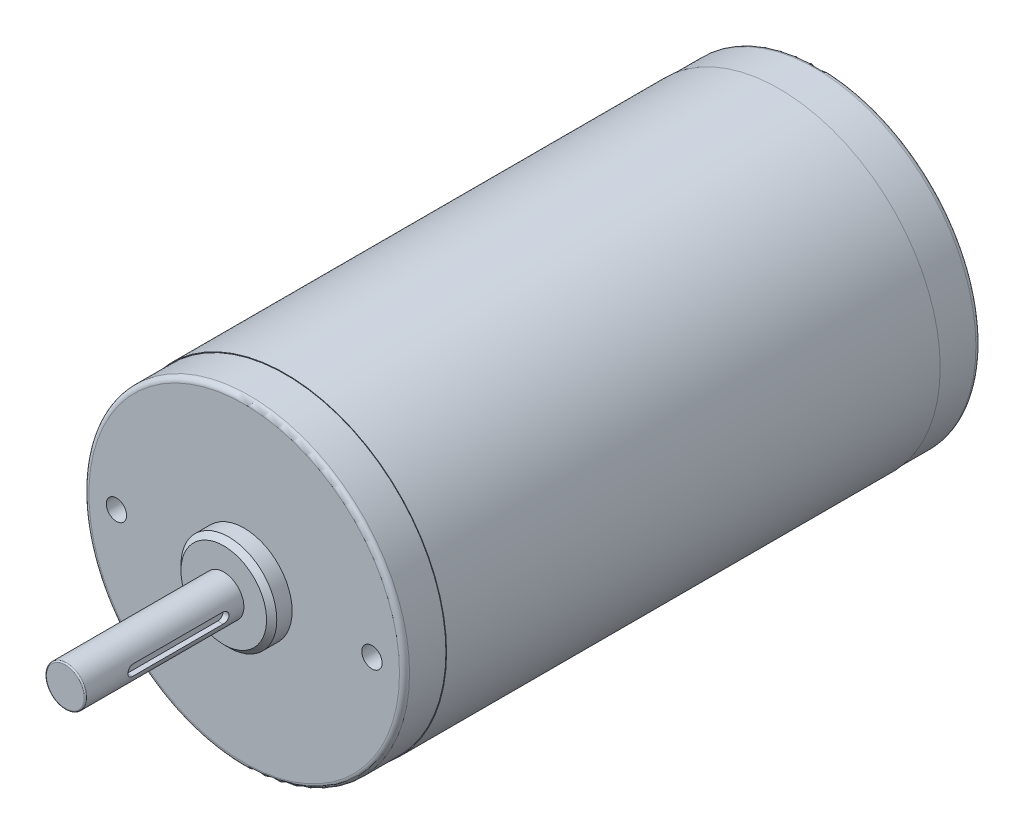
ISO-10303-21;
HEADER;
FILE_DESCRIPTION(('STEP AP214'),'2;1');
FILE_NAME('part.step','',(''),(''),'','','');
FILE_SCHEMA(('AUTOMOTIVE_DESIGN { 1 0 10303 214 1 1 1 1 }'));
ENDSEC;
DATA;
#1=APPLICATION_CONTEXT('core data for automotive mechanical design processes');
#2=APPLICATION_PROTOCOL_DEFINITION('international standard','automotive_design',2000,#1);
#3=PRODUCT_CONTEXT('',#1,'mechanical');
#4=PRODUCT('Part','Part','',(#3));
#5=PRODUCT_RELATED_PRODUCT_CATEGORY('part','',(#4));
#6=PRODUCT_DEFINITION_FORMATION('','',#4);
#7=PRODUCT_DEFINITION_CONTEXT('part definition',#1,'design');
#8=PRODUCT_DEFINITION('design','',#6,#7);
#9=PRODUCT_DEFINITION_SHAPE('','',#8);
#10=(LENGTH_UNIT() NAMED_UNIT(*) SI_UNIT(.MILLI.,.METRE.));
#11=(NAMED_UNIT(*) PLANE_ANGLE_UNIT() SI_UNIT($,.RADIAN.));
#12=(NAMED_UNIT(*) SI_UNIT($,.STERADIAN.) SOLID_ANGLE_UNIT());
#13=UNCERTAINTY_MEASURE_WITH_UNIT(LENGTH_MEASURE(1.E-05),#10,'distance_accuracy_value','');
#14=(GEOMETRIC_REPRESENTATION_CONTEXT(3) GLOBAL_UNCERTAINTY_ASSIGNED_CONTEXT((#13)) GLOBAL_UNIT_ASSIGNED_CONTEXT((#10,
#11,#12)) REPRESENTATION_CONTEXT('',''));
#15=CARTESIAN_POINT('',(0.,0.,0.));
#16=DIRECTION('',(0.,0.,1.));
#17=DIRECTION('',(1.,0.,0.));
#18=AXIS2_PLACEMENT_3D('',#15,#16,#17);
#19=CARTESIAN_POINT('',(35.56,109.2962,54.614));
#20=DIRECTION('',(0.,0.,1.));
#21=DIRECTION('',(1.,0.,0.));
#22=AXIS2_PLACEMENT_3D('',#19,#20,#21);
#23=PLANE('',#22);
#24=CARTESIAN_POINT('',(35.56,109.2962,54.614));
#25=DIRECTION('',(0.,0.,-1.));
#26=DIRECTION('',(1.,0.,0.));
#27=AXIS2_PLACEMENT_3D('',#24,#25,#26);
#28=CIRCLE('',#27,3.7460000000201);
#29=CARTESIAN_POINT('',(39.3060000000201,109.2962,54.614));
#30=VERTEX_POINT('',#29);
#31=EDGE_CURVE('E76',#30,#30,#28,.T.);
#32=ORIENTED_EDGE('',*,*,#31,.F.);
#33=EDGE_LOOP('',(#32));
#34=FACE_BOUND('',#33,.T.);
#35=ADVANCED_FACE('F17',(#34),#23,.T.);
#36=CARTESIAN_POINT('',(38.36,109.2962,16.4984772078548));
#37=DIRECTION('',(1.,0.,0.));
#38=DIRECTION('',(0.,0.,-1.));
#39=AXIS2_PLACEMENT_3D('',#36,#37,#38);
#40=PLANE('',#39);
#41=DIRECTION('',(0.,0.,1.));
#42=VECTOR('',#41,1.);
#43=CARTESIAN_POINT('',(38.36,108.2462,16.4984772078548));
#44=LINE('',#43,#42);
#45=CARTESIAN_POINT('',(38.36,108.2462,27.1));
#46=VERTEX_POINT('',#45);
#47=CARTESIAN_POINT('',(38.36,108.2462,45.1));
#48=VERTEX_POINT('',#47);
#49=EDGE_CURVE('E58',#46,#48,#44,.T.);
#50=ORIENTED_EDGE('',*,*,#49,.F.);
#51=CARTESIAN_POINT('',(38.36,109.2962,27.1));
#52=DIRECTION('',(-1.,0.,0.));
#53=DIRECTION('',(0.,0.,1.));
#54=AXIS2_PLACEMENT_3D('',#51,#52,#53);
#55=CIRCLE('',#54,1.05);
#56=CARTESIAN_POINT('',(38.36,110.3462,27.1));
#57=VERTEX_POINT('',#56);
#58=EDGE_CURVE('E21',#46,#57,#55,.F.);
#59=ORIENTED_EDGE('',*,*,#58,.T.);
#60=DIRECTION('',(0.,0.,1.));
#61=VECTOR('',#60,1.);
#62=CARTESIAN_POINT('',(38.36,110.3462,16.4984772078548));
#63=LINE('',#62,#61);
#64=CARTESIAN_POINT('',(38.36,110.3462,45.1));
#65=VERTEX_POINT('',#64);
#66=EDGE_CURVE('E88',#57,#65,#63,.T.);
#67=ORIENTED_EDGE('',*,*,#66,.T.);
#68=CARTESIAN_POINT('',(38.36,109.2962,45.1));
#69=DIRECTION('',(-1.,0.,0.));
#70=DIRECTION('',(0.,0.,1.));
#71=AXIS2_PLACEMENT_3D('',#68,#69,#70);
#72=CIRCLE('',#71,1.05);
#73=EDGE_CURVE('E63',#65,#48,#72,.F.);
#74=ORIENTED_EDGE('',*,*,#73,.T.);
#75=EDGE_LOOP('',(#50,#59,#67,#74));
#76=FACE_BOUND('',#75,.T.);
#77=ADVANCED_FACE('F60',(#76),#40,.T.);
#78=CARTESIAN_POINT('',(35.56,109.2962,54.36));
#79=DIRECTION('',(0.,0.,1.));
#80=DIRECTION('',(1.,0.,0.));
#81=AXIS2_PLACEMENT_3D('',#78,#79,#80);
#82=TOROIDAL_SURFACE('',#81,3.746,0.254);
#83=CARTESIAN_POINT('',(35.56,109.2962,54.36000000001));
#84=DIRECTION('',(0.,0.,1.));
#85=DIRECTION('',(1.,0.,0.));
#86=AXIS2_PLACEMENT_3D('',#83,#84,#85);
#87=CIRCLE('',#86,4.);
#88=CARTESIAN_POINT('',(39.56,109.2962,54.36000000001));
#89=VERTEX_POINT('',#88);
#90=EDGE_CURVE('E330',#89,#89,#87,.F.);
#91=ORIENTED_EDGE('',*,*,#90,.F.);
#92=EDGE_LOOP('',(#91));
#93=FACE_BOUND('',#92,.T.);
#94=ORIENTED_EDGE('',*,*,#31,.T.);
#95=EDGE_LOOP('',(#94));
#96=FACE_BOUND('',#95,.T.);
#97=ADVANCED_FACE('F90',(#93,#96),#82,.T.);
#98=CARTESIAN_POINT('',(38.36,109.2962,27.1));
#99=DIRECTION('',(-1.,0.,0.));
#100=DIRECTION('',(0.,0.,1.));
#101=AXIS2_PLACEMENT_3D('',#98,#99,#100);
#102=CYLINDRICAL_SURFACE('',#101,1.05);
#103=ORIENTED_EDGE('',*,*,#58,.F.);
#104=DIRECTION('',(1.,0.,0.));
#105=VECTOR('',#104,1.);
#106=CARTESIAN_POINT('',(38.36,108.2462,27.1));
#107=LINE('',#106,#105);
#108=CARTESIAN_POINT('',(39.4197279696891,108.2462,27.1));
#109=VERTEX_POINT('',#108);
#110=EDGE_CURVE('E68',#109,#46,#107,.F.);
#111=ORIENTED_EDGE('',*,*,#110,.F.);
#112=CARTESIAN_POINT('',(39.4197279696891,110.3462,27.1));
#113=CARTESIAN_POINT('',(39.4197258950768,110.34620041025,27.0710051009623));
#114=CARTESIAN_POINT('',(39.4200551064328,110.344998227256,27.0420246228058));
#115=CARTESIAN_POINT('',(39.4213547123987,110.340206209835,26.9842814282389));
#116=CARTESIAN_POINT('',(39.4223249908092,110.336616808112,26.9555186733196));
#117=CARTESIAN_POINT('',(39.4261578920523,110.322321932764,26.8699951160553));
#118=CARTESIAN_POINT('',(39.4299428342911,110.308089542303,26.8138236492985));
#119=CARTESIAN_POINT('',(39.4395286889103,110.270686835054,26.7047742036821));
#120=CARTESIAN_POINT('',(39.445329326456,110.247517736714,26.6518957769836));
#121=CARTESIAN_POINT('',(39.4582892232805,110.192930496084,26.5507488556207));
#122=CARTESIAN_POINT('',(39.4654488628843,110.161510043656,26.5024816571346));
#123=CARTESIAN_POINT('',(39.4805119710477,110.090509636998,26.4107922298844));
#124=CARTESIAN_POINT('',(39.4884281885094,110.050767743087,26.3674975328551));
#125=CARTESIAN_POINT('',(39.5040047400554,109.964586854037,26.2880931254824));
#126=CARTESIAN_POINT('',(39.5116649818292,109.91814547434,26.2519859843525));
#127=CARTESIAN_POINT('',(39.526010604883,109.818987620195,26.1874496103786));
#128=CARTESIAN_POINT('',(39.5326785635433,109.766183168704,26.159151481312));
#129=CARTESIAN_POINT('',(39.5441298010582,109.656397945762,26.1119111599868));
#130=CARTESIAN_POINT('',(39.5489153447306,109.599422291421,26.0929577177131));
#131=CARTESIAN_POINT('',(39.5549473168841,109.501171577289,26.0693758272655));
#132=CARTESIAN_POINT('',(39.5568321627735,109.46054623456,26.0621227253234));
#133=CARTESIAN_POINT('',(39.5593590428506,109.378686103609,26.052433965248));
#134=CARTESIAN_POINT('',(39.5600011009139,109.337451327111,26.0499982145665));
#135=CARTESIAN_POINT('',(39.55999845492,109.238305738357,26.0500025057704));
#136=CARTESIAN_POINT('',(39.5587300938833,109.180378877339,26.0548061723029));
#137=CARTESIAN_POINT('',(39.5537908073877,109.066174828257,26.0738680806171));
#138=CARTESIAN_POINT('',(39.5501176251492,109.009899241695,26.0881352034471));
#139=CARTESIAN_POINT('',(39.5407752151886,108.900688958064,26.1256289904428));
#140=CARTESIAN_POINT('',(39.5351088856793,108.847749541003,26.148842650214));
#141=CARTESIAN_POINT('',(39.5223803452477,108.746519851806,26.2035277086069));
#142=CARTESIAN_POINT('',(39.5153181479082,108.698229534436,26.2349990268771));
#143=CARTESIAN_POINT('',(39.5003832391546,108.606575585264,26.3060552920619));
#144=CARTESIAN_POINT('',(39.4924970081333,108.563331555532,26.3457916691671));
#145=CARTESIAN_POINT('',(39.4768899553604,108.484036309153,26.431929982209));
#146=CARTESIAN_POINT('',(39.4691691622904,108.447986330864,26.4783330633665));
#147=CARTESIAN_POINT('',(39.4546281048764,108.383519395399,26.5774412854526));
#148=CARTESIAN_POINT('',(39.4478252173029,108.355241372008,26.6302394851058));
#149=CARTESIAN_POINT('',(39.4360941322254,108.308025058775,26.7400354515098));
#150=CARTESIAN_POINT('',(39.4311644713834,108.289079475123,26.7970298984879));
#151=CARTESIAN_POINT('',(39.424947536189,108.265530062073,26.8952701656664));
#152=CARTESIAN_POINT('',(39.4230031721685,108.258293447667,26.9358624533813));
#153=CARTESIAN_POINT('',(39.4203876966156,108.248624950633,27.0176289590907));
#154=CARTESIAN_POINT('',(39.4197157897859,108.246190066839,27.058802797386));
#155=CARTESIAN_POINT('',(39.4197279696891,108.2462,27.1));
#156=B_SPLINE_CURVE_WITH_KNOTS('',3,(#112,#113,#114,#115,#116,#117,#118,#119,#120,#121,#122,
#123,#124,#125,#126,#127,#128,#129,#130,#131,#132,#133,#134,#135,#136,#137,#138,#139,#140,#141,
#142,#143,#144,#145,#146,#147,#148,#149,#150,#151,#152,#153,#154,#155),.UNSPECIFIED.,.F.,.F.,(4,
2,2,2,2,2,2,2,2,2,2,2,2,2,2,2,2,2,2,2,2,4),(0.,0.0869295778834455,0.173843403286118,
0.347151826879624,0.520436629596133,0.693769998810187,0.870856390838599,1.04800596970822,
1.22797015523126,1.40771715061753,1.53136439682191,1.65500926755904,1.8285389209936,
2.00223165541559,2.17567286221396,2.34911238140169,2.52606492372391,2.70304789975981,
2.88301467869372,3.06284057971519,3.18638852057382,3.30985921734619),.UNSPECIFIED.);
#157=CARTESIAN_POINT('',(39.4197279696891,110.3462,27.1));
#158=VERTEX_POINT('',#157);
#159=EDGE_CURVE('E161',#158,#109,#156,.T.);
#160=ORIENTED_EDGE('',*,*,#159,.F.);
#161=DIRECTION('',(1.,0.,0.));
#162=VECTOR('',#161,1.);
#163=CARTESIAN_POINT('',(38.36,110.3462,27.1));
#164=LINE('',#163,#162);
#165=EDGE_CURVE('E74',#158,#57,#164,.F.);
#166=ORIENTED_EDGE('',*,*,#165,.T.);
#167=EDGE_LOOP('',(#103,#111,#160,#166));
#168=FACE_BOUND('',#167,.T.);
#169=ADVANCED_FACE('F71',(#168),#102,.F.);
#170=CARTESIAN_POINT('',(38.36,108.2462,16.4984772078548));
#171=DIRECTION('',(0.,1.,0.));
#172=DIRECTION('',(0.,0.,1.));
#173=AXIS2_PLACEMENT_3D('',#170,#171,#172);
#174=PLANE('',#173);
#175=DIRECTION('',(0.,0.,1.));
#176=VECTOR('',#175,1.);
#177=CARTESIAN_POINT('',(39.4197279696891,108.2462,54.614));
#178=LINE('',#177,#176);
#179=CARTESIAN_POINT('',(39.4197279696891,108.2462,45.1));
#180=VERTEX_POINT('',#179);
#181=EDGE_CURVE('E79',#109,#180,#178,.T.);
#182=ORIENTED_EDGE('',*,*,#181,.F.);
#183=ORIENTED_EDGE('',*,*,#110,.T.);
#184=ORIENTED_EDGE('',*,*,#49,.T.);
#185=DIRECTION('',(-1.,0.,0.));
#186=VECTOR('',#185,1.);
#187=CARTESIAN_POINT('',(38.36,108.2462,45.1));
#188=LINE('',#187,#186);
#189=EDGE_CURVE('E82',#48,#180,#188,.F.);
#190=ORIENTED_EDGE('',*,*,#189,.T.);
#191=EDGE_LOOP('',(#182,#183,#184,#190));
#192=FACE_BOUND('',#191,.T.);
#193=ADVANCED_FACE('F77',(#192),#174,.T.);
#194=CARTESIAN_POINT('',(38.36,109.2962,45.1));
#195=DIRECTION('',(-1.,0.,0.));
#196=DIRECTION('',(0.,0.,1.));
#197=AXIS2_PLACEMENT_3D('',#194,#195,#196);
#198=CYLINDRICAL_SURFACE('',#197,1.05);
#199=ORIENTED_EDGE('',*,*,#73,.F.);
#200=DIRECTION('',(1.,0.,0.));
#201=VECTOR('',#200,1.);
#202=CARTESIAN_POINT('',(38.36,110.3462,45.1));
#203=LINE('',#202,#201);
#204=CARTESIAN_POINT('',(39.4197279696891,110.3462,45.1));
#205=VERTEX_POINT('',#204);
#206=EDGE_CURVE('E333',#65,#205,#203,.T.);
#207=ORIENTED_EDGE('',*,*,#206,.T.);
#208=CARTESIAN_POINT('',(39.4197279696891,108.2462,45.1));
#209=CARTESIAN_POINT('',(39.4197258950768,108.24619958975,45.1289948990377));
#210=CARTESIAN_POINT('',(39.4200551064328,108.247401772744,45.1579753771942));
#211=CARTESIAN_POINT('',(39.4213547123987,108.252193790165,45.2157185717611));
#212=CARTESIAN_POINT('',(39.4223249908092,108.255783191888,45.2444813266804));
#213=CARTESIAN_POINT('',(39.4261578920523,108.270078067236,45.3300048839447));
#214=CARTESIAN_POINT('',(39.4299428342911,108.284310457697,45.3861763507015));
#215=CARTESIAN_POINT('',(39.4395286889103,108.321713164946,45.4952257963179));
#216=CARTESIAN_POINT('',(39.445329326456,108.344882263286,45.5481042230164));
#217=CARTESIAN_POINT('',(39.4582892232805,108.399469503916,45.6492511443793));
#218=CARTESIAN_POINT('',(39.4654488628843,108.430889956344,45.6975183428654));
#219=CARTESIAN_POINT('',(39.4805119710477,108.501890363002,45.7892077701156));
#220=CARTESIAN_POINT('',(39.4884281885094,108.541632256913,45.8325024671449));
#221=CARTESIAN_POINT('',(39.5040047400554,108.627813145963,45.9119068745175));
#222=CARTESIAN_POINT('',(39.5116649818292,108.67425452566,45.9480140156475));
#223=CARTESIAN_POINT('',(39.526010604883,108.773412379805,46.0125503896214));
#224=CARTESIAN_POINT('',(39.5326785635433,108.826216831296,46.040848518688));
#225=CARTESIAN_POINT('',(39.5441298010582,108.936002054238,46.0880888400132));
#226=CARTESIAN_POINT('',(39.5489153447306,108.992977708579,46.1070422822868));
#227=CARTESIAN_POINT('',(39.5549473168841,109.091228422711,46.1306241727345));
#228=CARTESIAN_POINT('',(39.5568321627735,109.13185376544,46.1378772746766));
#229=CARTESIAN_POINT('',(39.5593590428506,109.213713896391,46.147566034752));
#230=CARTESIAN_POINT('',(39.560001100914,109.254948672889,46.1500017854335));
#231=CARTESIAN_POINT('',(39.55999845492,109.354094261643,46.1499974942296));
#232=CARTESIAN_POINT('',(39.5587300938833,109.412021122661,46.1451938276971));
#233=CARTESIAN_POINT('',(39.5537908073877,109.526225171743,46.1261319193829));
#234=CARTESIAN_POINT('',(39.5501176251492,109.582500758305,46.1118647965529));
#235=CARTESIAN_POINT('',(39.5407752151886,109.691711041936,46.0743710095572));
#236=CARTESIAN_POINT('',(39.5351088856793,109.744650458997,46.051157349786));
#237=CARTESIAN_POINT('',(39.5223803452477,109.845880148194,45.9964722913931));
#238=CARTESIAN_POINT('',(39.5153181479082,109.894170465564,45.9650009731229));
#239=CARTESIAN_POINT('',(39.5003832391546,109.985824414736,45.8939447079381));
#240=CARTESIAN_POINT('',(39.4924970081333,110.029068444468,45.8542083308329));
#241=CARTESIAN_POINT('',(39.4768899553604,110.108363690847,45.768070017791));
#242=CARTESIAN_POINT('',(39.4691691622904,110.144413669136,45.7216669366335));
#243=CARTESIAN_POINT('',(39.4546281048764,110.208880604601,45.6225587145474));
#244=CARTESIAN_POINT('',(39.4478252173029,110.237158627992,45.5697605148942));
#245=CARTESIAN_POINT('',(39.4360941322254,110.284374941225,45.4599645484902));
#246=CARTESIAN_POINT('',(39.4311644713834,110.303320524877,45.4029701015121));
#247=CARTESIAN_POINT('',(39.424947536189,110.326869937927,45.3047298343336));
#248=CARTESIAN_POINT('',(39.4230031721685,110.334106552333,45.2641375466187));
#249=CARTESIAN_POINT('',(39.4203876966156,110.343775049367,45.1823710409093));
#250=CARTESIAN_POINT('',(39.4197157897859,110.346209933161,45.141197202614));
#251=CARTESIAN_POINT('',(39.4197279696891,110.3462,45.1));
#252=B_SPLINE_CURVE_WITH_KNOTS('',3,(#208,#209,#210,#211,#212,#213,#214,#215,#216,#217,#218,
#219,#220,#221,#222,#223,#224,#225,#226,#227,#228,#229,#230,#231,#232,#233,#234,#235,#236,#237,
#238,#239,#240,#241,#242,#243,#244,#245,#246,#247,#248,#249,#250,#251),.UNSPECIFIED.,.F.,.F.,(4,
2,2,2,2,2,2,2,2,2,2,2,2,2,2,2,2,2,2,2,2,4),(0.,0.0869295778834421,0.173843403286125,
0.347151826879624,0.520436629596126,0.693769998810186,0.870856390838596,1.04800596970822,
1.22797015523124,1.40771715061751,1.53136439682191,1.65500926755904,1.8285389209936,
2.00223165541559,2.17567286221396,2.34911238140169,2.52606492372391,2.70304789975981,
2.88301467869373,3.0628405797152,3.18638852057382,3.30985921734619),.UNSPECIFIED.);
#253=EDGE_CURVE('E153',#180,#205,#252,.T.);
#254=ORIENTED_EDGE('',*,*,#253,.F.);
#255=ORIENTED_EDGE('',*,*,#189,.F.);
#256=EDGE_LOOP('',(#199,#207,#254,#255));
#257=FACE_BOUND('',#256,.T.);
#258=ADVANCED_FACE('F165',(#257),#198,.F.);
#259=CARTESIAN_POINT('',(38.36,110.3462,16.4984772078548));
#260=DIRECTION('',(0.,1.,0.));
#261=DIRECTION('',(0.,0.,1.));
#262=AXIS2_PLACEMENT_3D('',#259,#260,#261);
#263=PLANE('',#262);
#264=ORIENTED_EDGE('',*,*,#206,.F.);
#265=ORIENTED_EDGE('',*,*,#66,.F.);
#266=ORIENTED_EDGE('',*,*,#165,.F.);
#267=DIRECTION('',(0.,0.,1.));
#268=VECTOR('',#267,1.);
#269=CARTESIAN_POINT('',(39.4197279696891,110.3462,54.614));
#270=LINE('',#269,#268);
#271=EDGE_CURVE('E152',#205,#158,#270,.F.);
#272=ORIENTED_EDGE('',*,*,#271,.F.);
#273=EDGE_LOOP('',(#264,#265,#266,#272));
#274=FACE_BOUND('',#273,.T.);
#275=ADVANCED_FACE('F173',(#274),#263,.F.);
#276=CARTESIAN_POINT('',(35.56,109.2962,54.614));
#277=DIRECTION('',(0.,0.,1.));
#278=DIRECTION('',(1.,0.,0.));
#279=AXIS2_PLACEMENT_3D('',#276,#277,#278);
#280=CYLINDRICAL_SURFACE('',#279,4.);
#281=ORIENTED_EDGE('',*,*,#253,.T.);
#282=ORIENTED_EDGE('',*,*,#271,.T.);
#283=ORIENTED_EDGE('',*,*,#159,.T.);
#284=ORIENTED_EDGE('',*,*,#181,.T.);
#285=EDGE_LOOP('',(#281,#282,#283,#284));
#286=FACE_BOUND('',#285,.T.);
#287=ORIENTED_EDGE('',*,*,#90,.T.);
#288=EDGE_LOOP('',(#287));
#289=FACE_BOUND('',#288,.T.);
#290=CARTESIAN_POINT('',(35.56,109.2962,23.11400000001));
#291=DIRECTION('',(0.,0.,1.));
#292=DIRECTION('',(1.,0.,0.));
#293=AXIS2_PLACEMENT_3D('',#290,#291,#292);
#294=CIRCLE('',#293,4.);
#295=CARTESIAN_POINT('',(39.56,109.2962,23.11400000001));
#296=VERTEX_POINT('',#295);
#297=EDGE_CURVE('E149',#296,#296,#294,.F.);
#298=ORIENTED_EDGE('',*,*,#297,.F.);
#299=EDGE_LOOP('',(#298));
#300=FACE_BOUND('',#299,.T.);
#301=ADVANCED_FACE('F168',(#286,#289,#300),#280,.T.);
#302=CARTESIAN_POINT('',(48.8853596371201,127.903290682857,-97.8026999980236));
#303=DIRECTION('',(0.,0.,-1.));
#304=DIRECTION('',(-1.,0.,0.));
#305=AXIS2_PLACEMENT_3D('',#302,#303,#304);
#306=PLANE('',#305);
#307=CARTESIAN_POINT('',(46.76735963712,127.903290682857,-97.8026999970893));
#308=DIRECTION('',(0.,0.,1.));
#309=DIRECTION('',(1.,0.,0.));
#310=AXIS2_PLACEMENT_3D('',#307,#308,#309);
#311=CIRCLE('',#310,2.1179999989541);
#312=CARTESIAN_POINT('',(48.8853596360741,127.903290682857,-97.8026999970893));
#313=VERTEX_POINT('',#312);
#314=EDGE_CURVE('E146',#313,#313,#311,.T.);
#315=ORIENTED_EDGE('',*,*,#314,.F.);
#316=EDGE_LOOP('',(#315));
#317=FACE_BOUND('',#316,.T.);
#318=ADVANCED_FACE('F172',(#317),#306,.T.);
#319=CARTESIAN_POINT('',(56.2850906808812,120.503559639096,-97.8026999980238));
#320=DIRECTION('',(0.,0.,-1.));
#321=DIRECTION('',(-1.,0.,0.));
#322=AXIS2_PLACEMENT_3D('',#319,#320,#321);
#323=PLANE('',#322);
#324=CARTESIAN_POINT('',(54.1670906808811,120.503559639096,-97.8026999970325));
#325=DIRECTION('',(0.,0.,1.));
#326=DIRECTION('',(1.,0.,0.));
#327=AXIS2_PLACEMENT_3D('',#324,#325,#326);
#328=CIRCLE('',#327,2.11799999904017);
#329=CARTESIAN_POINT('',(56.2850906799213,120.503559639096,-97.8026999970325));
#330=VERTEX_POINT('',#329);
#331=EDGE_CURVE('E143',#330,#330,#328,.T.);
#332=ORIENTED_EDGE('',*,*,#331,.F.);
#333=EDGE_LOOP('',(#332));
#334=FACE_BOUND('',#333,.T.);
#335=ADVANCED_FACE('F426',(#334),#323,.T.);
#336=CARTESIAN_POINT('',(35.56,109.2962,-100.317299999998));
#337=DIRECTION('',(0.,0.,-1.));
#338=DIRECTION('',(-1.,0.,0.));
#339=AXIS2_PLACEMENT_3D('',#336,#337,#338);
#340=PLANE('',#339);
#341=CARTESIAN_POINT('',(35.56,109.2962,-100.317299999998));
#342=DIRECTION('',(0.,0.,1.));
#343=DIRECTION('',(-1.,0.,0.));
#344=AXIS2_PLACEMENT_3D('',#341,#342,#343);
#345=CIRCLE('',#344,14.0368000000003);
#346=CARTESIAN_POINT('',(21.5231999999997,109.2962,-100.317299999998));
#347=VERTEX_POINT('',#346);
#348=EDGE_CURVE('E142',#347,#347,#345,.T.);
#349=ORIENTED_EDGE('',*,*,#348,.F.);
#350=EDGE_LOOP('',(#349));
#351=FACE_BOUND('',#350,.T.);
#352=ADVANCED_FACE('F346',(#351),#340,.T.);
#353=CARTESIAN_POINT('',(35.56,109.2962,23.114));
#354=DIRECTION('',(0.,0.,1.));
#355=DIRECTION('',(1.,0.,0.));
#356=AXIS2_PLACEMENT_3D('',#353,#354,#355);
#357=PLANE('',#356);
#358=ORIENTED_EDGE('',*,*,#297,.T.);
#359=EDGE_LOOP('',(#358));
#360=FACE_BOUND('',#359,.T.);
#361=CARTESIAN_POINT('',(35.56,109.2962,23.1139999999949));
#362=DIRECTION('',(0.,0.,-1.));
#363=DIRECTION('',(-1.,0.,0.));
#364=AXIS2_PLACEMENT_3D('',#361,#362,#363);
#365=CIRCLE('',#364,8.5090000018283);
#366=CARTESIAN_POINT('',(27.0509999981717,109.2962,23.1139999999949));
#367=VERTEX_POINT('',#366);
#368=EDGE_CURVE('E138',#367,#367,#365,.T.);
#369=ORIENTED_EDGE('',*,*,#368,.F.);
#370=EDGE_LOOP('',(#369));
#371=FACE_BOUND('',#370,.T.);
#372=ADVANCED_FACE('F342',(#360,#371),#357,.T.);
#373=CARTESIAN_POINT('',(46.76735963712,127.903290682857,-95.6026999950836));
#374=DIRECTION('',(0.,0.,1.));
#375=DIRECTION('',(1.,0.,0.));
#376=AXIS2_PLACEMENT_3D('',#373,#374,#375);
#377=CONICAL_SURFACE('',#376,4.31800000095981,0.785398163397448);
#378=ORIENTED_EDGE('',*,*,#314,.T.);
#379=EDGE_LOOP('',(#378));
#380=FACE_BOUND('',#379,.T.);
#381=CARTESIAN_POINT('',(46.76735963712,127.903290682857,-95.6026999960591));
#382=DIRECTION('',(0.,0.,-1.));
#383=DIRECTION('',(-1.,0.,0.));
#384=AXIS2_PLACEMENT_3D('',#381,#382,#383);
#385=CIRCLE('',#384,4.318);
#386=CARTESIAN_POINT('',(42.44935963712,127.903290682857,-95.6026999960591));
#387=VERTEX_POINT('',#386);
#388=EDGE_CURVE('E141',#387,#387,#385,.F.);
#389=ORIENTED_EDGE('',*,*,#388,.F.);
#390=EDGE_LOOP('',(#389));
#391=FACE_BOUND('',#390,.T.);
#392=ADVANCED_FACE('F345',(#380,#391),#377,.T.);
#393=CARTESIAN_POINT('',(54.1670906808811,120.503559639096,-95.6026999950268));
#394=DIRECTION('',(0.,0.,1.));
#395=DIRECTION('',(1.,0.,0.));
#396=AXIS2_PLACEMENT_3D('',#393,#394,#395);
#397=CONICAL_SURFACE('',#396,4.31800000104587,0.785398163397448);
#398=ORIENTED_EDGE('',*,*,#331,.T.);
#399=EDGE_LOOP('',(#398));
#400=FACE_BOUND('',#399,.T.);
#401=CARTESIAN_POINT('',(54.1670906808811,120.503559639096,-95.6026999960594));
#402=DIRECTION('',(0.,0.,-1.));
#403=DIRECTION('',(-1.,0.,0.));
#404=AXIS2_PLACEMENT_3D('',#401,#402,#403);
#405=CIRCLE('',#404,4.318);
#406=CARTESIAN_POINT('',(49.8490906808811,120.503559639096,-95.6026999960594));
#407=VERTEX_POINT('',#406);
#408=EDGE_CURVE('E290',#407,#407,#405,.F.);
#409=ORIENTED_EDGE('',*,*,#408,.F.);
#410=EDGE_LOOP('',(#409));
#411=FACE_BOUND('',#410,.T.);
#412=ADVANCED_FACE('F312',(#400,#411),#397,.T.);
#413=CARTESIAN_POINT('',(35.56,109.2962,-99.317299999998));
#414=DIRECTION('',(0.,0.,-1.));
#415=DIRECTION('',(-1.,0.,0.));
#416=AXIS2_PLACEMENT_3D('',#413,#414,#415);
#417=TOROIDAL_SURFACE('',#416,14.0368,1.);
#418=CARTESIAN_POINT('',(35.56,109.2962,-99.317300000008));
#419=DIRECTION('',(0.,0.,-1.));
#420=DIRECTION('',(-1.,0.,0.));
#421=AXIS2_PLACEMENT_3D('',#418,#419,#420);
#422=CIRCLE('',#421,15.0368);
#423=CARTESIAN_POINT('',(20.5232,109.2962,-99.317300000008));
#424=VERTEX_POINT('',#423);
#425=EDGE_CURVE('E285',#424,#424,#422,.F.);
#426=ORIENTED_EDGE('',*,*,#425,.F.);
#427=EDGE_LOOP('',(#426));
#428=FACE_BOUND('',#427,.T.);
#429=ORIENTED_EDGE('',*,*,#348,.T.);
#430=EDGE_LOOP('',(#429));
#431=FACE_BOUND('',#430,.T.);
#432=ADVANCED_FACE('F306',(#428,#431),#417,.T.);
#433=CARTESIAN_POINT('',(10.1599999999994,109.2962,5.43559999999843));
#434=DIRECTION('',(0.,0.,1.));
#435=DIRECTION('',(1.,0.,0.));
#436=AXIS2_PLACEMENT_3D('',#433,#434,#435);
#437=CONICAL_SURFACE('',#436,2.01930000001448,1.02974425749912);
#438=CARTESIAN_POINT('',(10.1599999999848,109.2962,4.22228214875986));
#439=VERTEX_POINT('',#438);
#440=VERTEX_LOOP('',#439);
#441=FACE_BOUND('',#440,.T.);
#442=CARTESIAN_POINT('',(10.1599999999994,109.2962,5.4356000000107));
#443=DIRECTION('',(0.,0.,-1.));
#444=DIRECTION('',(-1.,0.,0.));
#445=AXIS2_PLACEMENT_3D('',#442,#443,#444);
#446=CIRCLE('',#445,2.0193);
#447=CARTESIAN_POINT('',(8.1406999999994,109.2962,5.4356000000107));
#448=VERTEX_POINT('',#447);
#449=EDGE_CURVE('E280',#448,#448,#446,.F.);
#450=ORIENTED_EDGE('',*,*,#449,.T.);
#451=EDGE_LOOP('',(#450));
#452=FACE_BOUND('',#451,.T.);
#453=ADVANCED_FACE('F311',(#441,#452),#437,.F.);
#454=CARTESIAN_POINT('',(60.96,109.2962,5.43559999988474));
#455=DIRECTION('',(0.,0.,1.));
#456=DIRECTION('',(1.,0.,0.));
#457=AXIS2_PLACEMENT_3D('',#454,#455,#456);
#458=CONICAL_SURFACE('',#457,2.01929999976759,1.02974425734563);
#459=CARTESIAN_POINT('',(60.9599999998522,109.2962,4.22228214870302));
#460=VERTEX_POINT('',#459);
#461=VERTEX_LOOP('',#460);
#462=FACE_BOUND('',#461,.T.);
#463=CARTESIAN_POINT('',(60.96,109.2962,5.43560000001074));
#464=DIRECTION('',(0.,0.,-1.));
#465=DIRECTION('',(-1.,0.,0.));
#466=AXIS2_PLACEMENT_3D('',#463,#464,#465);
#467=CIRCLE('',#466,2.0193);
#468=CARTESIAN_POINT('',(58.9407,109.2962,5.43560000001074));
#469=VERTEX_POINT('',#468);
#470=EDGE_CURVE('E275',#469,#469,#467,.F.);
#471=ORIENTED_EDGE('',*,*,#470,.T.);
#472=EDGE_LOOP('',(#471));
#473=FACE_BOUND('',#472,.T.);
#474=ADVANCED_FACE('F354',(#462,#473),#458,.F.);
#475=CARTESIAN_POINT('',(35.56,109.2962,22.0979999999945));
#476=DIRECTION('',(0.,0.,-1.));
#477=DIRECTION('',(-1.,0.,0.));
#478=AXIS2_PLACEMENT_3D('',#475,#476,#477);
#479=CONICAL_SURFACE('',#478,9.5250000000051,0.7853981625);
#480=ORIENTED_EDGE('',*,*,#368,.T.);
#481=EDGE_LOOP('',(#480));
#482=FACE_BOUND('',#481,.T.);
#483=CARTESIAN_POINT('',(35.56,109.2962,22.0980000000096));
#484=DIRECTION('',(0.,0.,1.));
#485=DIRECTION('',(1.,0.,0.));
#486=AXIS2_PLACEMENT_3D('',#483,#484,#485);
#487=CIRCLE('',#486,9.525);
#488=CARTESIAN_POINT('',(45.085,109.2962,22.0980000000096));
#489=VERTEX_POINT('',#488);
#490=EDGE_CURVE('E137',#489,#489,#487,.F.);
#491=ORIENTED_EDGE('',*,*,#490,.F.);
#492=EDGE_LOOP('',(#491));
#493=FACE_BOUND('',#492,.T.);
#494=ADVANCED_FACE('F350',(#482,#493),#479,.T.);
#495=CARTESIAN_POINT('',(46.76735963712,127.903290682857,-97.8026999980236));
#496=DIRECTION('',(0.,0.,-1.));
#497=DIRECTION('',(-1.,0.,0.));
#498=AXIS2_PLACEMENT_3D('',#495,#496,#497);
#499=CYLINDRICAL_SURFACE('',#498,4.318);
#500=ORIENTED_EDGE('',*,*,#388,.T.);
#501=EDGE_LOOP('',(#500));
#502=FACE_BOUND('',#501,.T.);
#503=CARTESIAN_POINT('',(46.76735963712,127.903290682857,-95.554800000008));
#504=DIRECTION('',(0.,0.,-1.));
#505=DIRECTION('',(-1.,0.,0.));
#506=AXIS2_PLACEMENT_3D('',#503,#504,#505);
#507=CIRCLE('',#506,4.318);
#508=CARTESIAN_POINT('',(42.44935963712,127.903290682857,-95.554800000008));
#509=VERTEX_POINT('',#508);
#510=EDGE_CURVE('E134',#509,#509,#507,.F.);
#511=ORIENTED_EDGE('',*,*,#510,.F.);
#512=EDGE_LOOP('',(#511));
#513=FACE_BOUND('',#512,.T.);
#514=ADVANCED_FACE('F353',(#502,#513),#499,.T.);
#515=CARTESIAN_POINT('',(54.1670906808811,120.503559639096,-97.8026999980238));
#516=DIRECTION('',(0.,0.,-1.));
#517=DIRECTION('',(-1.,0.,0.));
#518=AXIS2_PLACEMENT_3D('',#515,#516,#517);
#519=CYLINDRICAL_SURFACE('',#518,4.318);
#520=ORIENTED_EDGE('',*,*,#408,.T.);
#521=EDGE_LOOP('',(#520));
#522=FACE_BOUND('',#521,.T.);
#523=CARTESIAN_POINT('',(54.1670906808811,120.503559639096,-95.554800000008));
#524=DIRECTION('',(0.,0.,-1.));
#525=DIRECTION('',(-1.,0.,0.));
#526=AXIS2_PLACEMENT_3D('',#523,#524,#525);
#527=CIRCLE('',#526,4.318);
#528=CARTESIAN_POINT('',(49.8490906808811,120.503559639096,-95.554800000008));
#529=VERTEX_POINT('',#528);
#530=EDGE_CURVE('E131',#529,#529,#527,.F.);
#531=ORIENTED_EDGE('',*,*,#530,.F.);
#532=EDGE_LOOP('',(#531));
#533=FACE_BOUND('',#532,.T.);
#534=ADVANCED_FACE('F377',(#522,#533),#519,.T.);
#535=CARTESIAN_POINT('',(35.56,109.2962,-100.317299999998));
#536=DIRECTION('',(0.,0.,-1.));
#537=DIRECTION('',(-1.,0.,0.));
#538=AXIS2_PLACEMENT_3D('',#535,#536,#537);
#539=CYLINDRICAL_SURFACE('',#538,15.0368);
#540=ORIENTED_EDGE('',*,*,#425,.T.);
#541=EDGE_LOOP('',(#540));
#542=FACE_BOUND('',#541,.T.);
#543=CARTESIAN_POINT('',(35.56,109.2962,-95.554800000008));
#544=DIRECTION('',(0.,0.,-1.));
#545=DIRECTION('',(-1.,0.,0.));
#546=AXIS2_PLACEMENT_3D('',#543,#544,#545);
#547=CIRCLE('',#546,15.0368);
#548=CARTESIAN_POINT('',(20.5232,109.2962,-95.554800000008));
#549=VERTEX_POINT('',#548);
#550=EDGE_CURVE('E128',#549,#549,#547,.F.);
#551=ORIENTED_EDGE('',*,*,#550,.F.);
#552=EDGE_LOOP('',(#551));
#553=FACE_BOUND('',#552,.T.);
#554=ADVANCED_FACE('F369',(#542,#553),#539,.T.);
#555=CARTESIAN_POINT('',(10.1599999999994,109.2962,19.05));
#556=DIRECTION('',(0.,0.,-1.));
#557=DIRECTION('',(-1.,0.,0.));
#558=AXIS2_PLACEMENT_3D('',#555,#556,#557);
#559=CYLINDRICAL_SURFACE('',#558,2.0193);
#560=ORIENTED_EDGE('',*,*,#449,.F.);
#561=EDGE_LOOP('',(#560));
#562=FACE_BOUND('',#561,.T.);
#563=CARTESIAN_POINT('',(10.1599999999994,109.2962,19.05000000001));
#564=DIRECTION('',(0.,0.,-1.));
#565=DIRECTION('',(-1.,0.,0.));
#566=AXIS2_PLACEMENT_3D('',#563,#564,#565);
#567=CIRCLE('',#566,2.0193);
#568=CARTESIAN_POINT('',(8.1406999999994,109.2962,19.05000000001));
#569=VERTEX_POINT('',#568);
#570=EDGE_CURVE('E125',#569,#569,#567,.T.);
#571=ORIENTED_EDGE('',*,*,#570,.F.);
#572=EDGE_LOOP('',(#571));
#573=FACE_BOUND('',#572,.T.);
#574=ADVANCED_FACE('F367',(#562,#573),#559,.F.);
#575=CARTESIAN_POINT('',(60.96,109.2962,19.05));
#576=DIRECTION('',(0.,0.,-1.));
#577=DIRECTION('',(-1.,0.,0.));
#578=AXIS2_PLACEMENT_3D('',#575,#576,#577);
#579=CYLINDRICAL_SURFACE('',#578,2.0193);
#580=ORIENTED_EDGE('',*,*,#470,.F.);
#581=EDGE_LOOP('',(#580));
#582=FACE_BOUND('',#581,.T.);
#583=CARTESIAN_POINT('',(60.96,109.2962,19.05000000001));
#584=DIRECTION('',(0.,0.,-1.));
#585=DIRECTION('',(-1.,0.,0.));
#586=AXIS2_PLACEMENT_3D('',#583,#584,#585);
#587=CIRCLE('',#586,2.0193);
#588=CARTESIAN_POINT('',(58.9407,109.2962,19.05000000001));
#589=VERTEX_POINT('',#588);
#590=EDGE_CURVE('E122',#589,#589,#587,.T.);
#591=ORIENTED_EDGE('',*,*,#590,.F.);
#592=EDGE_LOOP('',(#591));
#593=FACE_BOUND('',#592,.T.);
#594=ADVANCED_FACE('F360',(#582,#593),#579,.F.);
#595=CARTESIAN_POINT('',(35.56,109.2962,23.114));
#596=DIRECTION('',(0.,0.,1.));
#597=DIRECTION('',(1.,0.,0.));
#598=AXIS2_PLACEMENT_3D('',#595,#596,#597);
#599=CYLINDRICAL_SURFACE('',#598,9.525);
#600=ORIENTED_EDGE('',*,*,#490,.T.);
#601=EDGE_LOOP('',(#600));
#602=FACE_BOUND('',#601,.T.);
#603=CARTESIAN_POINT('',(35.56,109.2962,19.05000000001));
#604=DIRECTION('',(0.,0.,1.));
#605=DIRECTION('',(1.,0.,0.));
#606=AXIS2_PLACEMENT_3D('',#603,#604,#605);
#607=CIRCLE('',#606,9.525);
#608=CARTESIAN_POINT('',(45.085,109.2962,19.05000000001));
#609=VERTEX_POINT('',#608);
#610=EDGE_CURVE('E118',#609,#609,#607,.F.);
#611=ORIENTED_EDGE('',*,*,#610,.F.);
#612=EDGE_LOOP('',(#611));
#613=FACE_BOUND('',#612,.T.);
#614=ADVANCED_FACE('F248',(#602,#613),#599,.T.);
#615=CARTESIAN_POINT('',(35.56,109.2962,-95.554799999998));
#616=DIRECTION('',(0.,0.,-1.));
#617=DIRECTION('',(-1.,0.,0.));
#618=AXIS2_PLACEMENT_3D('',#615,#616,#617);
#619=PLANE('',#618);
#620=ORIENTED_EDGE('',*,*,#550,.T.);
#621=EDGE_LOOP('',(#620));
#622=FACE_BOUND('',#621,.T.);
#623=ORIENTED_EDGE('',*,*,#530,.T.);
#624=EDGE_LOOP('',(#623));
#625=FACE_BOUND('',#624,.T.);
#626=ORIENTED_EDGE('',*,*,#510,.T.);
#627=EDGE_LOOP('',(#626));
#628=FACE_BOUND('',#627,.T.);
#629=CARTESIAN_POINT('',(35.56,109.2962,-95.554799999998));
#630=DIRECTION('',(0.,0.,1.));
#631=DIRECTION('',(-1.,0.,0.));
#632=AXIS2_PLACEMENT_3D('',#629,#630,#631);
#633=CIRCLE('',#632,30.8770000000005);
#634=CARTESIAN_POINT('',(4.6829999999995,109.2962,-95.554799999998));
#635=VERTEX_POINT('',#634);
#636=EDGE_CURVE('E121',#635,#635,#633,.T.);
#637=ORIENTED_EDGE('',*,*,#636,.F.);
#638=EDGE_LOOP('',(#637));
#639=FACE_BOUND('',#638,.T.);
#640=ADVANCED_FACE('F243',(#622,#625,#628,#639),#619,.T.);
#641=CARTESIAN_POINT('',(35.56,109.2962,19.05));
#642=DIRECTION('',(0.,0.,1.));
#643=DIRECTION('',(1.,0.,0.));
#644=AXIS2_PLACEMENT_3D('',#641,#642,#643);
#645=PLANE('',#644);
#646=ORIENTED_EDGE('',*,*,#610,.T.);
#647=EDGE_LOOP('',(#646));
#648=FACE_BOUND('',#647,.T.);
#649=ORIENTED_EDGE('',*,*,#590,.T.);
#650=EDGE_LOOP('',(#649));
#651=FACE_BOUND('',#650,.T.);
#652=ORIENTED_EDGE('',*,*,#570,.T.);
#653=EDGE_LOOP('',(#652));
#654=FACE_BOUND('',#653,.T.);
#655=CARTESIAN_POINT('',(35.56,109.2962,19.05));
#656=DIRECTION('',(0.,0.,-1.));
#657=DIRECTION('',(1.,0.,0.));
#658=AXIS2_PLACEMENT_3D('',#655,#656,#657);
#659=CIRCLE('',#658,30.8770000000205);
#660=CARTESIAN_POINT('',(66.4370000000205,109.2962,19.05));
#661=VERTEX_POINT('',#660);
#662=EDGE_CURVE('E230',#661,#661,#659,.T.);
#663=ORIENTED_EDGE('',*,*,#662,.F.);
#664=EDGE_LOOP('',(#663));
#665=FACE_BOUND('',#664,.T.);
#666=ADVANCED_FACE('F234',(#648,#651,#654,#665),#645,.T.);
#667=CARTESIAN_POINT('',(35.56,109.2962,-94.554799999998));
#668=DIRECTION('',(0.,0.,-1.));
#669=DIRECTION('',(-1.,0.,0.));
#670=AXIS2_PLACEMENT_3D('',#667,#668,#669);
#671=TOROIDAL_SURFACE('',#670,30.877,1.);
#672=CARTESIAN_POINT('',(35.56,109.2962,-94.554800000008));
#673=DIRECTION('',(0.,0.,-1.));
#674=DIRECTION('',(-1.,0.,0.));
#675=AXIS2_PLACEMENT_3D('',#672,#673,#674);
#676=CIRCLE('',#675,31.877);
#677=CARTESIAN_POINT('',(3.683,109.2962,-94.554800000008));
#678=VERTEX_POINT('',#677);
#679=EDGE_CURVE('E688',#678,#678,#676,.F.);
#680=ORIENTED_EDGE('',*,*,#679,.F.);
#681=EDGE_LOOP('',(#680));
#682=FACE_BOUND('',#681,.T.);
#683=ORIENTED_EDGE('',*,*,#636,.T.);
#684=EDGE_LOOP('',(#683));
#685=FACE_BOUND('',#684,.T.);
#686=ADVANCED_FACE('F214',(#682,#685),#671,.T.);
#687=CARTESIAN_POINT('',(35.56,109.2962,18.05));
#688=DIRECTION('',(0.,0.,1.));
#689=DIRECTION('',(1.,0.,0.));
#690=AXIS2_PLACEMENT_3D('',#687,#688,#689);
#691=TOROIDAL_SURFACE('',#690,30.877,1.);
#692=CARTESIAN_POINT('',(35.56,109.2962,18.05000000001));
#693=DIRECTION('',(0.,0.,1.));
#694=DIRECTION('',(1.,0.,0.));
#695=AXIS2_PLACEMENT_3D('',#692,#693,#694);
#696=CIRCLE('',#695,31.877);
#697=CARTESIAN_POINT('',(67.437,109.2962,18.05000000001));
#698=VERTEX_POINT('',#697);
#699=EDGE_CURVE('E117',#698,#698,#696,.F.);
#700=ORIENTED_EDGE('',*,*,#699,.F.);
#701=EDGE_LOOP('',(#700));
#702=FACE_BOUND('',#701,.T.);
#703=ORIENTED_EDGE('',*,*,#662,.T.);
#704=EDGE_LOOP('',(#703));
#705=FACE_BOUND('',#704,.T.);
#706=ADVANCED_FACE('F208',(#702,#705),#691,.T.);
#707=CARTESIAN_POINT('',(35.56,109.2962,-95.554799999998));
#708=DIRECTION('',(0.,0.,-1.));
#709=DIRECTION('',(-1.,0.,0.));
#710=AXIS2_PLACEMENT_3D('',#707,#708,#709);
#711=CYLINDRICAL_SURFACE('',#710,31.877);
#712=ORIENTED_EDGE('',*,*,#679,.T.);
#713=EDGE_LOOP('',(#712));
#714=FACE_BOUND('',#713,.T.);
#715=CARTESIAN_POINT('',(35.56,109.2962,-87.325200000008));
#716=DIRECTION('',(0.,0.,-1.));
#717=DIRECTION('',(-1.,0.,0.));
#718=AXIS2_PLACEMENT_3D('',#715,#716,#717);
#719=CIRCLE('',#718,31.877);
#720=CARTESIAN_POINT('',(3.683,109.2962,-87.325200000008));
#721=VERTEX_POINT('',#720);
#722=EDGE_CURVE('E114',#721,#721,#719,.F.);
#723=ORIENTED_EDGE('',*,*,#722,.F.);
#724=EDGE_LOOP('',(#723));
#725=FACE_BOUND('',#724,.T.);
#726=ADVANCED_FACE('F204',(#714,#725),#711,.T.);
#727=CARTESIAN_POINT('',(35.56,109.2962,19.05));
#728=DIRECTION('',(0.,0.,1.));
#729=DIRECTION('',(1.,0.,0.));
#730=AXIS2_PLACEMENT_3D('',#727,#728,#729);
#731=CYLINDRICAL_SURFACE('',#730,31.877);
#732=ORIENTED_EDGE('',*,*,#699,.T.);
#733=EDGE_LOOP('',(#732));
#734=FACE_BOUND('',#733,.T.);
#735=CARTESIAN_POINT('',(35.56,109.2962,10.8204000000107));
#736=DIRECTION('',(0.,0.,1.));
#737=DIRECTION('',(1.,0.,0.));
#738=AXIS2_PLACEMENT_3D('',#735,#736,#737);
#739=CIRCLE('',#738,31.877);
#740=CARTESIAN_POINT('',(67.437,109.2962,10.8204000000107));
#741=VERTEX_POINT('',#740);
#742=EDGE_CURVE('E111',#741,#741,#739,.F.);
#743=ORIENTED_EDGE('',*,*,#742,.F.);
#744=EDGE_LOOP('',(#743));
#745=FACE_BOUND('',#744,.T.);
#746=ADVANCED_FACE('F200',(#734,#745),#731,.T.);
#747=CARTESIAN_POINT('',(35.56,109.2962,-87.325199999998));
#748=DIRECTION('',(0.,0.,-1.));
#749=DIRECTION('',(-1.,0.,0.));
#750=AXIS2_PLACEMENT_3D('',#747,#748,#749);
#751=PLANE('',#750);
#752=ORIENTED_EDGE('',*,*,#722,.T.);
#753=EDGE_LOOP('',(#752));
#754=FACE_BOUND('',#753,.T.);
#755=CARTESIAN_POINT('',(35.56,109.2962,-87.325200000008));
#756=DIRECTION('',(0.,0.,1.));
#757=DIRECTION('',(1.,0.,0.));
#758=AXIS2_PLACEMENT_3D('',#755,#756,#757);
#759=CIRCLE('',#758,32.004);
#760=CARTESIAN_POINT('',(67.564,109.2962,-87.325200000008));
#761=VERTEX_POINT('',#760);
#762=EDGE_CURVE('E27',#761,#761,#759,.T.);
#763=ORIENTED_EDGE('',*,*,#762,.F.);
#764=EDGE_LOOP('',(#763));
#765=FACE_BOUND('',#764,.T.);
#766=ADVANCED_FACE('F193',(#754,#765),#751,.T.);
#767=CARTESIAN_POINT('',(67.564,109.2962,10.8204000000007));
#768=DIRECTION('',(0.,0.,1.));
#769=DIRECTION('',(1.,0.,0.));
#770=AXIS2_PLACEMENT_3D('',#767,#768,#769);
#771=PLANE('',#770);
#772=ORIENTED_EDGE('',*,*,#742,.T.);
#773=EDGE_LOOP('',(#772));
#774=FACE_BOUND('',#773,.T.);
#775=CARTESIAN_POINT('',(35.56,109.2962,10.8204000000107));
#776=DIRECTION('',(0.,0.,1.));
#777=DIRECTION('',(1.,0.,0.));
#778=AXIS2_PLACEMENT_3D('',#775,#776,#777);
#779=CIRCLE('',#778,32.004);
#780=CARTESIAN_POINT('',(67.564,109.2962,10.8204000000107));
#781=VERTEX_POINT('',#780);
#782=EDGE_CURVE('E11',#781,#781,#779,.F.);
#783=ORIENTED_EDGE('',*,*,#782,.F.);
#784=EDGE_LOOP('',(#783));
#785=FACE_BOUND('',#784,.T.);
#786=ADVANCED_FACE('F187',(#774,#785),#771,.T.);
#787=CARTESIAN_POINT('',(35.56,109.2962,10.8204000000007));
#788=DIRECTION('',(0.,0.,1.));
#789=DIRECTION('',(1.,0.,0.));
#790=AXIS2_PLACEMENT_3D('',#787,#788,#789);
#791=CYLINDRICAL_SURFACE('',#790,32.004);
#792=ORIENTED_EDGE('',*,*,#782,.T.);
#793=EDGE_LOOP('',(#792));
#794=FACE_BOUND('',#793,.T.);
#795=ORIENTED_EDGE('',*,*,#762,.T.);
#796=EDGE_LOOP('',(#795));
#797=FACE_BOUND('',#796,.T.);
#798=ADVANCED_FACE('F185',(#794,#797),#791,.T.);
#799=CLOSED_SHELL('',(#35,#77,#97,#169,#193,#258,#275,#301,#318,#335,#352,#372,#392,#412,#432,
#453,#474,#494,#514,#534,#554,#574,#594,#614,#640,#666,#686,#706,#726,#746,#766,#786,#798));
#800=MANIFOLD_SOLID_BREP('B1',#799);
#801=ADVANCED_BREP_SHAPE_REPRESENTATION('',(#18,#800),#14);
#802=SHAPE_DEFINITION_REPRESENTATION(#9,#801);
ENDSEC;
END-ISO-10303-21;
